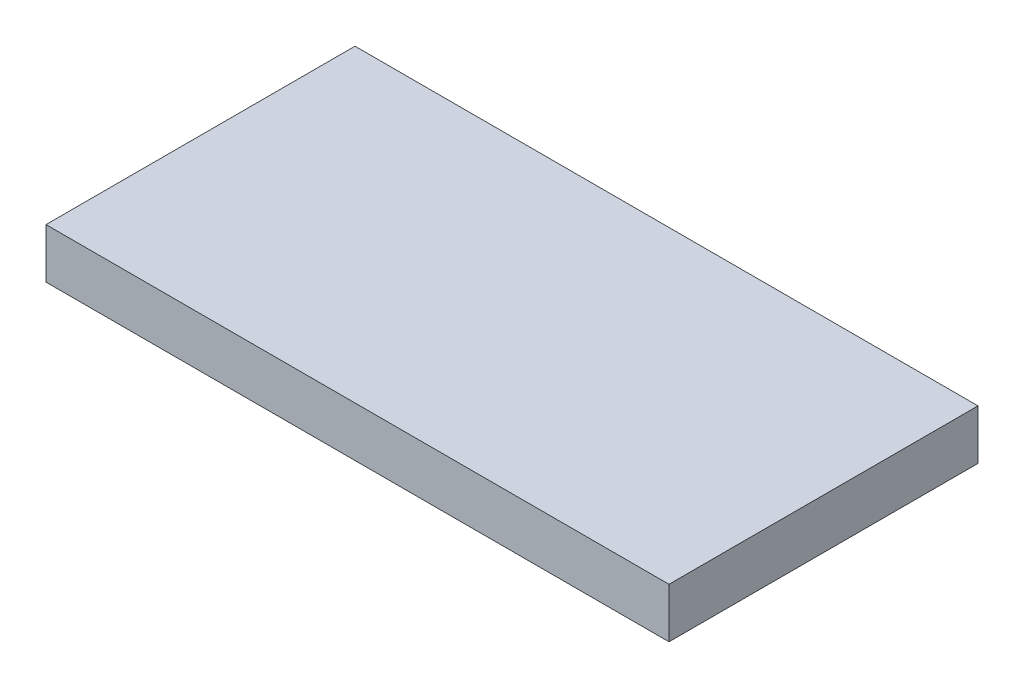
ISO-10303-21;
HEADER;
FILE_DESCRIPTION(('STEP AP214'),'2;1');
FILE_NAME('part.step','',(''),(''),'','','');
FILE_SCHEMA(('AUTOMOTIVE_DESIGN { 1 0 10303 214 1 1 1 1 }'));
ENDSEC;
DATA;
#1=APPLICATION_CONTEXT('core data for automotive mechanical design processes');
#2=APPLICATION_PROTOCOL_DEFINITION('international standard','automotive_design',2000,#1);
#3=PRODUCT_CONTEXT('',#1,'mechanical');
#4=PRODUCT('Part','Part','',(#3));
#5=PRODUCT_RELATED_PRODUCT_CATEGORY('part','',(#4));
#6=PRODUCT_DEFINITION_FORMATION('','',#4);
#7=PRODUCT_DEFINITION_CONTEXT('part definition',#1,'design');
#8=PRODUCT_DEFINITION('design','',#6,#7);
#9=PRODUCT_DEFINITION_SHAPE('','',#8);
#10=(LENGTH_UNIT() NAMED_UNIT(*) SI_UNIT(.MILLI.,.METRE.));
#11=(NAMED_UNIT(*) PLANE_ANGLE_UNIT() SI_UNIT($,.RADIAN.));
#12=(NAMED_UNIT(*) SI_UNIT($,.STERADIAN.) SOLID_ANGLE_UNIT());
#13=UNCERTAINTY_MEASURE_WITH_UNIT(LENGTH_MEASURE(1.E-05),#10,'distance_accuracy_value','');
#14=(GEOMETRIC_REPRESENTATION_CONTEXT(3) GLOBAL_UNCERTAINTY_ASSIGNED_CONTEXT((#13)) GLOBAL_UNIT_ASSIGNED_CONTEXT((#10,
#11,#12)) REPRESENTATION_CONTEXT('',''));
#15=CARTESIAN_POINT('',(0.,0.,0.));
#16=DIRECTION('',(0.,0.,1.));
#17=DIRECTION('',(1.,0.,0.));
#18=AXIS2_PLACEMENT_3D('',#15,#16,#17);
#19=CARTESIAN_POINT('',(0.603738674210153,38.4864983767566,241.578801425629));
#20=DIRECTION('',(0.,1.,0.));
#21=DIRECTION('',(0.,0.,1.));
#22=AXIS2_PLACEMENT_3D('',#19,#20,#21);
#23=PLANE('',#22);
#24=DIRECTION('',(0.,0.,-1.));
#25=VECTOR('',#24,1.);
#26=CARTESIAN_POINT('',(-0.983761325789853,38.4864983767566,240.791401425628));
#27=LINE('',#26,#25);
#28=CARTESIAN_POINT('',(-0.983761325789853,38.4864983767566,242.366201425629));
#29=VERTEX_POINT('',#28);
#30=CARTESIAN_POINT('',(-0.983761325789853,38.4864983767566,240.791401425628));
#31=VERTEX_POINT('',#30);
#32=EDGE_CURVE('E20',#29,#31,#27,.T.);
#33=ORIENTED_EDGE('',*,*,#32,.T.);
#34=DIRECTION('',(1.,0.,0.));
#35=VECTOR('',#34,1.);
#36=CARTESIAN_POINT('',(-0.983761325789853,38.4864983767566,240.791401425628));
#37=LINE('',#36,#35);
#38=CARTESIAN_POINT('',(2.19123867421014,38.4864983767566,240.791401425628));
#39=VERTEX_POINT('',#38);
#40=EDGE_CURVE('E88',#31,#39,#37,.T.);
#41=ORIENTED_EDGE('',*,*,#40,.T.);
#42=DIRECTION('',(0.,0.,1.));
#43=VECTOR('',#42,1.);
#44=CARTESIAN_POINT('',(2.19123867421014,38.4864983767566,240.791401425628));
#45=LINE('',#44,#43);
#46=CARTESIAN_POINT('',(2.19123867421014,38.4864983767566,242.366201425629));
#47=VERTEX_POINT('',#46);
#48=EDGE_CURVE('E56',#39,#47,#45,.T.);
#49=ORIENTED_EDGE('',*,*,#48,.T.);
#50=DIRECTION('',(-1.,0.,0.));
#51=VECTOR('',#50,1.);
#52=CARTESIAN_POINT('',(-0.983761325789853,38.4864983767566,242.366201425629));
#53=LINE('',#52,#51);
#54=EDGE_CURVE('E58',#47,#29,#53,.T.);
#55=ORIENTED_EDGE('',*,*,#54,.T.);
#56=EDGE_LOOP('',(#33,#41,#49,#55));
#57=FACE_BOUND('',#56,.T.);
#58=ADVANCED_FACE('F17',(#57),#23,.F.);
#59=CARTESIAN_POINT('',(-0.983761325789853,38.7404983767566,240.791401425628));
#60=DIRECTION('',(1.,0.,0.));
#61=DIRECTION('',(0.,0.,-1.));
#62=AXIS2_PLACEMENT_3D('',#59,#60,#61);
#63=PLANE('',#62);
#64=DIRECTION('',(0.,0.,1.));
#65=VECTOR('',#64,1.);
#66=CARTESIAN_POINT('',(-0.983761325789853,38.7404983767566,241.578801425629));
#67=LINE('',#66,#65);
#68=CARTESIAN_POINT('',(-0.983761325789853,38.7404983767566,240.791401425628));
#69=VERTEX_POINT('',#68);
#70=CARTESIAN_POINT('',(-0.983761325789853,38.7404983767566,242.366201425629));
#71=VERTEX_POINT('',#70);
#72=EDGE_CURVE('E95',#69,#71,#67,.T.);
#73=ORIENTED_EDGE('',*,*,#72,.F.);
#74=DIRECTION('',(0.,1.,0.));
#75=VECTOR('',#74,1.);
#76=CARTESIAN_POINT('',(-0.983761325789853,38.7404983767566,240.791401425628));
#77=LINE('',#76,#75);
#78=EDGE_CURVE('E70',#69,#31,#77,.F.);
#79=ORIENTED_EDGE('',*,*,#78,.T.);
#80=ORIENTED_EDGE('',*,*,#32,.F.);
#81=DIRECTION('',(0.,1.,0.));
#82=VECTOR('',#81,1.);
#83=CARTESIAN_POINT('',(-0.983761325789853,38.7404983767566,242.366201425629));
#84=LINE('',#83,#82);
#85=EDGE_CURVE('E65',#29,#71,#84,.T.);
#86=ORIENTED_EDGE('',*,*,#85,.T.);
#87=EDGE_LOOP('',(#73,#79,#80,#86));
#88=FACE_BOUND('',#87,.T.);
#89=ADVANCED_FACE('F67',(#88),#63,.F.);
#90=CARTESIAN_POINT('',(-0.983761325789853,38.7404983767566,242.366201425629));
#91=DIRECTION('',(0.,0.,-1.));
#92=DIRECTION('',(-1.,0.,0.));
#93=AXIS2_PLACEMENT_3D('',#90,#91,#92);
#94=PLANE('',#93);
#95=DIRECTION('',(1.,0.,0.));
#96=VECTOR('',#95,1.);
#97=CARTESIAN_POINT('',(0.603738674210153,38.7404983767566,242.366201425629));
#98=LINE('',#97,#96);
#99=CARTESIAN_POINT('',(2.19123867421014,38.7404983767566,242.366201425629));
#100=VERTEX_POINT('',#99);
#101=EDGE_CURVE('E75',#71,#100,#98,.T.);
#102=ORIENTED_EDGE('',*,*,#101,.F.);
#103=ORIENTED_EDGE('',*,*,#85,.F.);
#104=ORIENTED_EDGE('',*,*,#54,.F.);
#105=DIRECTION('',(0.,1.,0.));
#106=VECTOR('',#105,1.);
#107=CARTESIAN_POINT('',(2.19123867421014,38.7404983767566,242.366201425629));
#108=LINE('',#107,#106);
#109=EDGE_CURVE('E83',#47,#100,#108,.T.);
#110=ORIENTED_EDGE('',*,*,#109,.T.);
#111=EDGE_LOOP('',(#102,#103,#104,#110));
#112=FACE_BOUND('',#111,.T.);
#113=ADVANCED_FACE('F73',(#112),#94,.F.);
#114=CARTESIAN_POINT('',(2.19123867421014,38.7404983767566,240.791401425628));
#115=DIRECTION('',(-1.,0.,0.));
#116=DIRECTION('',(0.,0.,1.));
#117=AXIS2_PLACEMENT_3D('',#114,#115,#116);
#118=PLANE('',#117);
#119=DIRECTION('',(0.,0.,1.));
#120=VECTOR('',#119,1.);
#121=CARTESIAN_POINT('',(2.19123867421014,38.7404983767566,241.578801425629));
#122=LINE('',#121,#120);
#123=CARTESIAN_POINT('',(2.19123867421014,38.7404983767566,240.791401425628));
#124=VERTEX_POINT('',#123);
#125=EDGE_CURVE('E27',#100,#124,#122,.F.);
#126=ORIENTED_EDGE('',*,*,#125,.F.);
#127=ORIENTED_EDGE('',*,*,#109,.F.);
#128=ORIENTED_EDGE('',*,*,#48,.F.);
#129=DIRECTION('',(0.,1.,0.));
#130=VECTOR('',#129,1.);
#131=CARTESIAN_POINT('',(2.19123867421014,38.7404983767566,240.791401425628));
#132=LINE('',#131,#130);
#133=EDGE_CURVE('E36',#39,#124,#132,.T.);
#134=ORIENTED_EDGE('',*,*,#133,.T.);
#135=EDGE_LOOP('',(#126,#127,#128,#134));
#136=FACE_BOUND('',#135,.T.);
#137=ADVANCED_FACE('F102',(#136),#118,.F.);
#138=CARTESIAN_POINT('',(-0.983761325789853,38.7404983767566,240.791401425628));
#139=DIRECTION('',(0.,0.,1.));
#140=DIRECTION('',(1.,0.,0.));
#141=AXIS2_PLACEMENT_3D('',#138,#139,#140);
#142=PLANE('',#141);
#143=DIRECTION('',(1.,0.,0.));
#144=VECTOR('',#143,1.);
#145=CARTESIAN_POINT('',(0.603738674210153,38.7404983767566,240.791401425628));
#146=LINE('',#145,#144);
#147=EDGE_CURVE('E11',#124,#69,#146,.F.);
#148=ORIENTED_EDGE('',*,*,#147,.F.);
#149=ORIENTED_EDGE('',*,*,#133,.F.);
#150=ORIENTED_EDGE('',*,*,#40,.F.);
#151=ORIENTED_EDGE('',*,*,#78,.F.);
#152=EDGE_LOOP('',(#148,#149,#150,#151));
#153=FACE_BOUND('',#152,.T.);
#154=ADVANCED_FACE('F104',(#153),#142,.F.);
#155=CARTESIAN_POINT('',(0.603738674210153,38.7404983767566,241.578801425629));
#156=DIRECTION('',(0.,1.,0.));
#157=DIRECTION('',(0.,0.,1.));
#158=AXIS2_PLACEMENT_3D('',#155,#156,#157);
#159=PLANE('',#158);
#160=ORIENTED_EDGE('',*,*,#125,.T.);
#161=ORIENTED_EDGE('',*,*,#147,.T.);
#162=ORIENTED_EDGE('',*,*,#72,.T.);
#163=ORIENTED_EDGE('',*,*,#101,.T.);
#164=EDGE_LOOP('',(#160,#161,#162,#163));
#165=FACE_BOUND('',#164,.T.);
#166=ADVANCED_FACE('F101',(#165),#159,.T.);
#167=CLOSED_SHELL('',(#58,#89,#113,#137,#154,#166));
#168=MANIFOLD_SOLID_BREP('B1',#167);
#169=ADVANCED_BREP_SHAPE_REPRESENTATION('',(#18,#168),#14);
#170=SHAPE_DEFINITION_REPRESENTATION(#9,#169);
ENDSEC;
END-ISO-10303-21;
